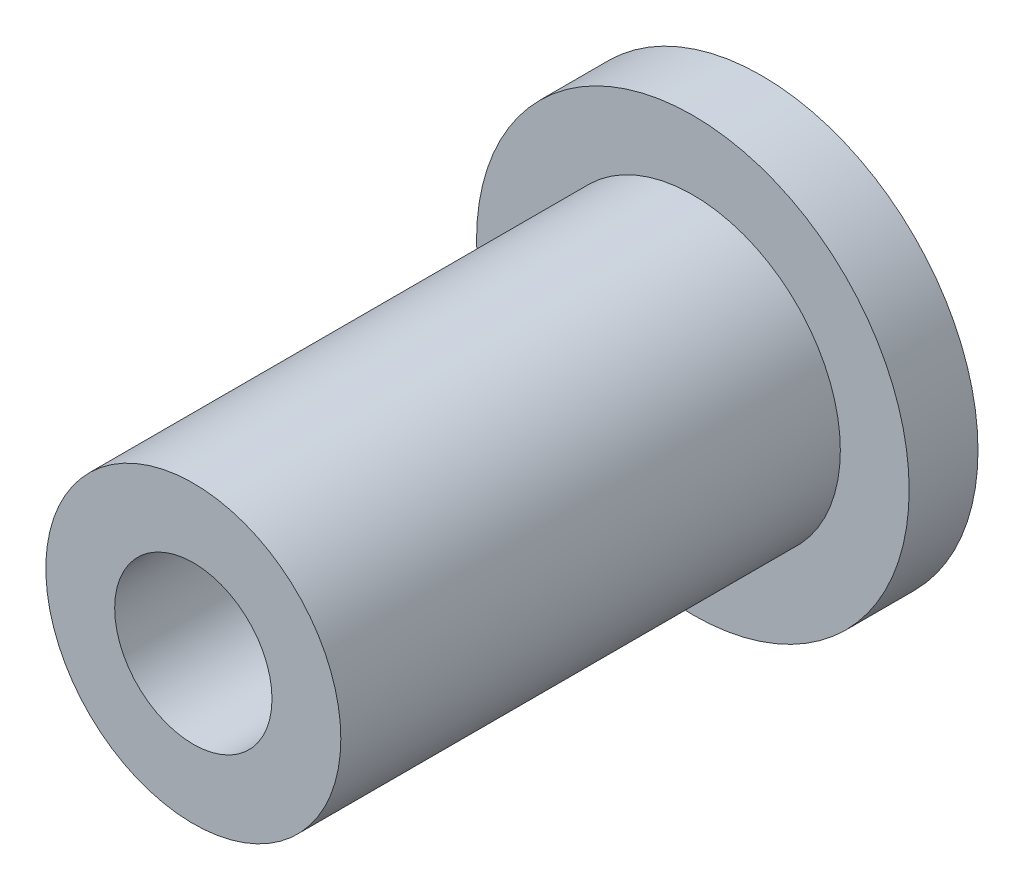
ISO-10303-21;
HEADER;
FILE_DESCRIPTION(('STEP AP214'),'2;1');
FILE_NAME('part.step','',(''),(''),'','','');
FILE_SCHEMA(('AUTOMOTIVE_DESIGN { 1 0 10303 214 1 1 1 1 }'));
ENDSEC;
DATA;
#1=APPLICATION_CONTEXT('core data for automotive mechanical design processes');
#2=APPLICATION_PROTOCOL_DEFINITION('international standard','automotive_design',2000,#1);
#3=PRODUCT_CONTEXT('',#1,'mechanical');
#4=PRODUCT('Part','Part','',(#3));
#5=PRODUCT_RELATED_PRODUCT_CATEGORY('part','',(#4));
#6=PRODUCT_DEFINITION_FORMATION('','',#4);
#7=PRODUCT_DEFINITION_CONTEXT('part definition',#1,'design');
#8=PRODUCT_DEFINITION('design','',#6,#7);
#9=PRODUCT_DEFINITION_SHAPE('','',#8);
#10=(LENGTH_UNIT() NAMED_UNIT(*) SI_UNIT(.MILLI.,.METRE.));
#11=(NAMED_UNIT(*) PLANE_ANGLE_UNIT() SI_UNIT($,.RADIAN.));
#12=(NAMED_UNIT(*) SI_UNIT($,.STERADIAN.) SOLID_ANGLE_UNIT());
#13=UNCERTAINTY_MEASURE_WITH_UNIT(LENGTH_MEASURE(1.E-05),#10,'distance_accuracy_value','');
#14=(GEOMETRIC_REPRESENTATION_CONTEXT(3) GLOBAL_UNCERTAINTY_ASSIGNED_CONTEXT((#13)) GLOBAL_UNIT_ASSIGNED_CONTEXT((#10,
#11,#12)) REPRESENTATION_CONTEXT('',''));
#15=CARTESIAN_POINT('',(0.,0.,0.));
#16=DIRECTION('',(0.,0.,1.));
#17=DIRECTION('',(1.,0.,0.));
#18=AXIS2_PLACEMENT_3D('',#15,#16,#17);
#19=CARTESIAN_POINT('',(0.,0.,12.7));
#20=DIRECTION('',(0.,0.,1.));
#21=DIRECTION('',(1.,0.,0.));
#22=AXIS2_PLACEMENT_3D('',#19,#20,#21);
#23=PLANE('',#22);
#24=CARTESIAN_POINT('',(0.,0.,12.7));
#25=DIRECTION('',(0.,0.,1.));
#26=DIRECTION('',(1.,0.,0.));
#27=AXIS2_PLACEMENT_3D('',#24,#25,#26);
#28=CIRCLE('',#27,7.5);
#29=CARTESIAN_POINT('',(7.5,0.,12.7));
#30=VERTEX_POINT('',#29);
#31=EDGE_CURVE('E10',#30,#30,#28,.T.);
#32=ORIENTED_EDGE('',*,*,#31,.T.);
#33=EDGE_LOOP('',(#32));
#34=FACE_BOUND('',#33,.T.);
#35=CARTESIAN_POINT('',(0.,0.,12.7));
#36=DIRECTION('',(0.,0.,1.));
#37=DIRECTION('',(1.,0.,0.));
#38=AXIS2_PLACEMENT_3D('',#35,#36,#37);
#39=CIRCLE('',#38,4.);
#40=CARTESIAN_POINT('',(4.,0.,12.7));
#41=VERTEX_POINT('',#40);
#42=EDGE_CURVE('E56',#41,#41,#39,.T.);
#43=ORIENTED_EDGE('',*,*,#42,.F.);
#44=EDGE_LOOP('',(#43));
#45=FACE_BOUND('',#44,.T.);
#46=ADVANCED_FACE('F47',(#34,#45),#23,.T.);
#47=CARTESIAN_POINT('',(0.,0.,12.7));
#48=DIRECTION('',(0.,0.,-1.));
#49=DIRECTION('',(-1.,0.,0.));
#50=AXIS2_PLACEMENT_3D('',#47,#48,#49);
#51=CYLINDRICAL_SURFACE('',#50,7.5);
#52=ORIENTED_EDGE('',*,*,#31,.F.);
#53=EDGE_LOOP('',(#52));
#54=FACE_BOUND('',#53,.T.);
#55=CARTESIAN_POINT('',(0.,0.,-12.7));
#56=DIRECTION('',(0.,0.,1.));
#57=DIRECTION('',(1.,0.,0.));
#58=AXIS2_PLACEMENT_3D('',#55,#56,#57);
#59=CIRCLE('',#58,7.5);
#60=CARTESIAN_POINT('',(7.5,0.,-12.7));
#61=VERTEX_POINT('',#60);
#62=EDGE_CURVE('E51',#61,#61,#59,.T.);
#63=ORIENTED_EDGE('',*,*,#62,.T.);
#64=EDGE_LOOP('',(#63));
#65=FACE_BOUND('',#64,.T.);
#66=ADVANCED_FACE('F49',(#54,#65),#51,.T.);
#67=CARTESIAN_POINT('',(0.,0.,12.7));
#68=DIRECTION('',(0.,0.,-1.));
#69=DIRECTION('',(-1.,0.,0.));
#70=AXIS2_PLACEMENT_3D('',#67,#68,#69);
#71=CYLINDRICAL_SURFACE('',#70,4.);
#72=ORIENTED_EDGE('',*,*,#42,.T.);
#73=EDGE_LOOP('',(#72));
#74=FACE_BOUND('',#73,.T.);
#75=CARTESIAN_POINT('',(0.,0.,-16.2));
#76=DIRECTION('',(0.,0.,-1.));
#77=DIRECTION('',(-1.,0.,0.));
#78=AXIS2_PLACEMENT_3D('',#75,#76,#77);
#79=CIRCLE('',#78,4.);
#80=CARTESIAN_POINT('',(-4.,0.,-16.2));
#81=VERTEX_POINT('',#80);
#82=EDGE_CURVE('E71',#81,#81,#79,.T.);
#83=ORIENTED_EDGE('',*,*,#82,.T.);
#84=EDGE_LOOP('',(#83));
#85=FACE_BOUND('',#84,.T.);
#86=ADVANCED_FACE('F76',(#74,#85),#71,.F.);
#87=CARTESIAN_POINT('',(-11.,0.,-12.7));
#88=DIRECTION('',(0.,0.,1.));
#89=DIRECTION('',(1.,0.,0.));
#90=AXIS2_PLACEMENT_3D('',#87,#88,#89);
#91=PLANE('',#90);
#92=ORIENTED_EDGE('',*,*,#62,.F.);
#93=EDGE_LOOP('',(#92));
#94=FACE_BOUND('',#93,.T.);
#95=CARTESIAN_POINT('',(0.,0.,-12.7));
#96=DIRECTION('',(0.,0.,-1.));
#97=DIRECTION('',(-1.,0.,0.));
#98=AXIS2_PLACEMENT_3D('',#95,#96,#97);
#99=CIRCLE('',#98,11.);
#100=CARTESIAN_POINT('',(-11.,0.,-12.7));
#101=VERTEX_POINT('',#100);
#102=EDGE_CURVE('E63',#101,#101,#99,.T.);
#103=ORIENTED_EDGE('',*,*,#102,.F.);
#104=EDGE_LOOP('',(#103));
#105=FACE_BOUND('',#104,.T.);
#106=ADVANCED_FACE('F86',(#94,#105),#91,.T.);
#107=CARTESIAN_POINT('',(0.,0.,-17.1778699373958));
#108=DIRECTION('',(0.,0.,-1.));
#109=DIRECTION('',(-1.,0.,0.));
#110=AXIS2_PLACEMENT_3D('',#107,#108,#109);
#111=CYLINDRICAL_SURFACE('',#110,11.);
#112=ORIENTED_EDGE('',*,*,#102,.T.);
#113=EDGE_LOOP('',(#112));
#114=FACE_BOUND('',#113,.T.);
#115=CARTESIAN_POINT('',(0.,0.,-16.2));
#116=DIRECTION('',(0.,0.,-1.));
#117=DIRECTION('',(-1.,0.,0.));
#118=AXIS2_PLACEMENT_3D('',#115,#116,#117);
#119=CIRCLE('',#118,11.);
#120=CARTESIAN_POINT('',(-11.,0.,-16.2));
#121=VERTEX_POINT('',#120);
#122=EDGE_CURVE('E67',#121,#121,#119,.T.);
#123=ORIENTED_EDGE('',*,*,#122,.F.);
#124=EDGE_LOOP('',(#123));
#125=FACE_BOUND('',#124,.T.);
#126=ADVANCED_FACE('F80',(#114,#125),#111,.T.);
#127=CARTESIAN_POINT('',(-7.5,0.,-16.2));
#128=DIRECTION('',(0.,0.,-1.));
#129=DIRECTION('',(-1.,0.,0.));
#130=AXIS2_PLACEMENT_3D('',#127,#128,#129);
#131=PLANE('',#130);
#132=ORIENTED_EDGE('',*,*,#122,.T.);
#133=EDGE_LOOP('',(#132));
#134=FACE_BOUND('',#133,.T.);
#135=ORIENTED_EDGE('',*,*,#82,.F.);
#136=EDGE_LOOP('',(#135));
#137=FACE_BOUND('',#136,.T.);
#138=ADVANCED_FACE('F78',(#134,#137),#131,.T.);
#139=CLOSED_SHELL('',(#46,#66,#86,#106,#126,#138));
#140=MANIFOLD_SOLID_BREP('B2',#139);
#141=ADVANCED_BREP_SHAPE_REPRESENTATION('',(#18,#140),#14);
#142=SHAPE_DEFINITION_REPRESENTATION(#9,#141);
ENDSEC;
END-ISO-10303-21;
